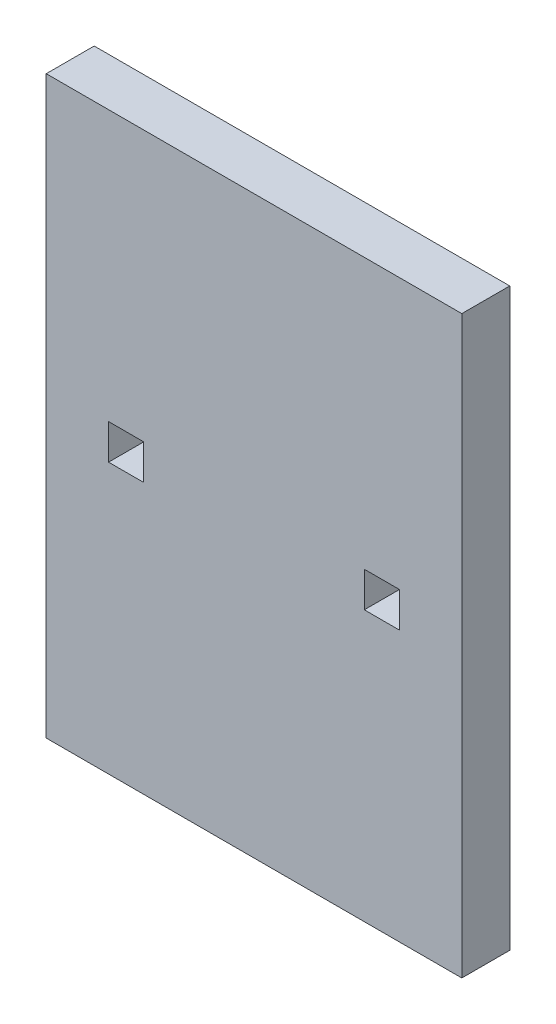
ISO-10303-21;
HEADER;
FILE_DESCRIPTION(('STEP AP214'),'2;1');
FILE_NAME('part.step','',(''),(''),'','','');
FILE_SCHEMA(('AUTOMOTIVE_DESIGN { 1 0 10303 214 1 1 1 1 }'));
ENDSEC;
DATA;
#1=APPLICATION_CONTEXT('core data for automotive mechanical design processes');
#2=APPLICATION_PROTOCOL_DEFINITION('international standard','automotive_design',2000,#1);
#3=PRODUCT_CONTEXT('',#1,'mechanical');
#4=PRODUCT('Part','Part','',(#3));
#5=PRODUCT_RELATED_PRODUCT_CATEGORY('part','',(#4));
#6=PRODUCT_DEFINITION_FORMATION('','',#4);
#7=PRODUCT_DEFINITION_CONTEXT('part definition',#1,'design');
#8=PRODUCT_DEFINITION('design','',#6,#7);
#9=PRODUCT_DEFINITION_SHAPE('','',#8);
#10=(LENGTH_UNIT() NAMED_UNIT(*) SI_UNIT(.MILLI.,.METRE.));
#11=(NAMED_UNIT(*) PLANE_ANGLE_UNIT() SI_UNIT($,.RADIAN.));
#12=(NAMED_UNIT(*) SI_UNIT($,.STERADIAN.) SOLID_ANGLE_UNIT());
#13=UNCERTAINTY_MEASURE_WITH_UNIT(LENGTH_MEASURE(1.E-05),#10,'distance_accuracy_value','');
#14=(GEOMETRIC_REPRESENTATION_CONTEXT(3) GLOBAL_UNCERTAINTY_ASSIGNED_CONTEXT((#13)) GLOBAL_UNIT_ASSIGNED_CONTEXT((#10,
#11,#12)) REPRESENTATION_CONTEXT('',''));
#15=CARTESIAN_POINT('',(0.,0.,0.));
#16=DIRECTION('',(0.,0.,1.));
#17=DIRECTION('',(1.,0.,0.));
#18=AXIS2_PLACEMENT_3D('',#15,#16,#17);
#19=CARTESIAN_POINT('',(0.,0.,30.));
#20=DIRECTION('',(0.,0.,1.));
#21=DIRECTION('',(1.,0.,0.));
#22=AXIS2_PLACEMENT_3D('',#19,#20,#21);
#23=PLANE('',#22);
#24=DIRECTION('',(0.,-1.,0.));
#25=VECTOR('',#24,1.);
#26=CARTESIAN_POINT('',(0.,0.,30.));
#27=LINE('',#26,#25);
#28=CARTESIAN_POINT('',(0.,0.,30.));
#29=VERTEX_POINT('',#28);
#30=CARTESIAN_POINT('',(0.,-360.,30.));
#31=VERTEX_POINT('',#30);
#32=EDGE_CURVE('E188',#29,#31,#27,.T.);
#33=ORIENTED_EDGE('',*,*,#32,.T.);
#34=DIRECTION('',(1.,0.,0.));
#35=VECTOR('',#34,1.);
#36=CARTESIAN_POINT('',(0.,-360.,30.));
#37=LINE('',#36,#35);
#38=CARTESIAN_POINT('',(260.,-360.,30.));
#39=VERTEX_POINT('',#38);
#40=EDGE_CURVE('E191',#31,#39,#37,.T.);
#41=ORIENTED_EDGE('',*,*,#40,.T.);
#42=DIRECTION('',(0.,1.,0.));
#43=VECTOR('',#42,1.);
#44=CARTESIAN_POINT('',(260.,0.,30.));
#45=LINE('',#44,#43);
#46=CARTESIAN_POINT('',(260.,0.,30.));
#47=VERTEX_POINT('',#46);
#48=EDGE_CURVE('E194',#39,#47,#45,.T.);
#49=ORIENTED_EDGE('',*,*,#48,.T.);
#50=DIRECTION('',(-1.,0.,0.));
#51=VECTOR('',#50,1.);
#52=CARTESIAN_POINT('',(0.,0.,30.));
#53=LINE('',#52,#51);
#54=EDGE_CURVE('E196',#47,#29,#53,.T.);
#55=ORIENTED_EDGE('',*,*,#54,.T.);
#56=EDGE_LOOP('',(#33,#41,#49,#55));
#57=FACE_BOUND('',#56,.T.);
#58=DIRECTION('',(-1.,0.,0.));
#59=VECTOR('',#58,1.);
#60=CARTESIAN_POINT('',(39.0000000000001,-169.,30.));
#61=LINE('',#60,#59);
#62=CARTESIAN_POINT('',(61.0000000000001,-169.,30.));
#63=VERTEX_POINT('',#62);
#64=CARTESIAN_POINT('',(39.0000000000001,-169.,30.));
#65=VERTEX_POINT('',#64);
#66=EDGE_CURVE('E159',#63,#65,#61,.T.);
#67=ORIENTED_EDGE('',*,*,#66,.F.);
#68=DIRECTION('',(0.,1.,0.));
#69=VECTOR('',#68,1.);
#70=CARTESIAN_POINT('',(61.0000000000001,-169.,30.));
#71=LINE('',#70,#69);
#72=CARTESIAN_POINT('',(61.0000000000001,-191.,30.));
#73=VERTEX_POINT('',#72);
#74=EDGE_CURVE('E157',#73,#63,#71,.T.);
#75=ORIENTED_EDGE('',*,*,#74,.F.);
#76=DIRECTION('',(1.,0.,0.));
#77=VECTOR('',#76,1.);
#78=CARTESIAN_POINT('',(39.0000000000001,-191.,30.));
#79=LINE('',#78,#77);
#80=CARTESIAN_POINT('',(39.0000000000001,-191.,30.));
#81=VERTEX_POINT('',#80);
#82=EDGE_CURVE('E165',#81,#73,#79,.T.);
#83=ORIENTED_EDGE('',*,*,#82,.F.);
#84=DIRECTION('',(0.,-1.,0.));
#85=VECTOR('',#84,1.);
#86=CARTESIAN_POINT('',(39.0000000000001,-169.,30.));
#87=LINE('',#86,#85);
#88=EDGE_CURVE('E162',#65,#81,#87,.T.);
#89=ORIENTED_EDGE('',*,*,#88,.F.);
#90=EDGE_LOOP('',(#67,#75,#83,#89));
#91=FACE_BOUND('',#90,.T.);
#92=DIRECTION('',(-1.,0.,0.));
#93=VECTOR('',#92,1.);
#94=CARTESIAN_POINT('',(199.,-169.,30.));
#95=LINE('',#94,#93);
#96=CARTESIAN_POINT('',(221.,-169.,30.));
#97=VERTEX_POINT('',#96);
#98=CARTESIAN_POINT('',(199.,-169.,30.));
#99=VERTEX_POINT('',#98);
#100=EDGE_CURVE('E129',#97,#99,#95,.T.);
#101=ORIENTED_EDGE('',*,*,#100,.F.);
#102=DIRECTION('',(0.,1.,0.));
#103=VECTOR('',#102,1.);
#104=CARTESIAN_POINT('',(221.,-169.,30.));
#105=LINE('',#104,#103);
#106=CARTESIAN_POINT('',(221.,-191.,30.));
#107=VERTEX_POINT('',#106);
#108=EDGE_CURVE('E121',#107,#97,#105,.T.);
#109=ORIENTED_EDGE('',*,*,#108,.F.);
#110=DIRECTION('',(1.,0.,0.));
#111=VECTOR('',#110,1.);
#112=CARTESIAN_POINT('',(199.,-191.,30.));
#113=LINE('',#112,#111);
#114=CARTESIAN_POINT('',(199.,-191.,30.));
#115=VERTEX_POINT('',#114);
#116=EDGE_CURVE('E143',#115,#107,#113,.T.);
#117=ORIENTED_EDGE('',*,*,#116,.F.);
#118=DIRECTION('',(0.,-1.,0.));
#119=VECTOR('',#118,1.);
#120=CARTESIAN_POINT('',(199.,-169.,30.));
#121=LINE('',#120,#119);
#122=EDGE_CURVE('E141',#99,#115,#121,.T.);
#123=ORIENTED_EDGE('',*,*,#122,.F.);
#124=EDGE_LOOP('',(#101,#109,#117,#123));
#125=FACE_BOUND('',#124,.T.);
#126=ADVANCED_FACE('F32',(#57,#91,#125),#23,.T.);
#127=CARTESIAN_POINT('',(0.,0.,0.));
#128=DIRECTION('',(0.,0.,1.));
#129=DIRECTION('',(1.,0.,0.));
#130=AXIS2_PLACEMENT_3D('',#127,#128,#129);
#131=PLANE('',#130);
#132=DIRECTION('',(0.,1.,0.));
#133=VECTOR('',#132,1.);
#134=CARTESIAN_POINT('',(61.0000000000001,-169.,0.));
#135=LINE('',#134,#133);
#136=CARTESIAN_POINT('',(61.0000000000001,-191.,0.));
#137=VERTEX_POINT('',#136);
#138=CARTESIAN_POINT('',(61.0000000000001,-169.,0.));
#139=VERTEX_POINT('',#138);
#140=EDGE_CURVE('E137',#137,#139,#135,.T.);
#141=ORIENTED_EDGE('',*,*,#140,.T.);
#142=DIRECTION('',(-1.,0.,0.));
#143=VECTOR('',#142,1.);
#144=CARTESIAN_POINT('',(39.0000000000001,-169.,0.));
#145=LINE('',#144,#143);
#146=CARTESIAN_POINT('',(39.0000000000001,-169.,0.));
#147=VERTEX_POINT('',#146);
#148=EDGE_CURVE('E170',#139,#147,#145,.T.);
#149=ORIENTED_EDGE('',*,*,#148,.T.);
#150=DIRECTION('',(0.,-1.,0.));
#151=VECTOR('',#150,1.);
#152=CARTESIAN_POINT('',(39.0000000000001,-169.,0.));
#153=LINE('',#152,#151);
#154=CARTESIAN_POINT('',(39.0000000000001,-191.,0.));
#155=VERTEX_POINT('',#154);
#156=EDGE_CURVE('E173',#147,#155,#153,.T.);
#157=ORIENTED_EDGE('',*,*,#156,.T.);
#158=DIRECTION('',(1.,0.,0.));
#159=VECTOR('',#158,1.);
#160=CARTESIAN_POINT('',(39.0000000000001,-191.,0.));
#161=LINE('',#160,#159);
#162=EDGE_CURVE('E160',#155,#137,#161,.T.);
#163=ORIENTED_EDGE('',*,*,#162,.T.);
#164=EDGE_LOOP('',(#141,#149,#157,#163));
#165=FACE_BOUND('',#164,.T.);
#166=DIRECTION('',(0.,-1.,0.));
#167=VECTOR('',#166,1.);
#168=CARTESIAN_POINT('',(0.,0.,0.));
#169=LINE('',#168,#167);
#170=CARTESIAN_POINT('',(0.,0.,0.));
#171=VERTEX_POINT('',#170);
#172=CARTESIAN_POINT('',(0.,-360.,0.));
#173=VERTEX_POINT('',#172);
#174=EDGE_CURVE('E187',#171,#173,#169,.T.);
#175=ORIENTED_EDGE('',*,*,#174,.F.);
#176=DIRECTION('',(-1.,0.,0.));
#177=VECTOR('',#176,1.);
#178=CARTESIAN_POINT('',(0.,0.,0.));
#179=LINE('',#178,#177);
#180=CARTESIAN_POINT('',(260.,0.,0.));
#181=VERTEX_POINT('',#180);
#182=EDGE_CURVE('E192',#181,#171,#179,.T.);
#183=ORIENTED_EDGE('',*,*,#182,.F.);
#184=DIRECTION('',(0.,1.,0.));
#185=VECTOR('',#184,1.);
#186=CARTESIAN_POINT('',(260.,0.,0.));
#187=LINE('',#186,#185);
#188=CARTESIAN_POINT('',(260.,-360.,0.));
#189=VERTEX_POINT('',#188);
#190=EDGE_CURVE('E203',#189,#181,#187,.T.);
#191=ORIENTED_EDGE('',*,*,#190,.F.);
#192=DIRECTION('',(1.,0.,0.));
#193=VECTOR('',#192,1.);
#194=CARTESIAN_POINT('',(0.,-360.,0.));
#195=LINE('',#194,#193);
#196=EDGE_CURVE('E201',#173,#189,#195,.T.);
#197=ORIENTED_EDGE('',*,*,#196,.F.);
#198=EDGE_LOOP('',(#175,#183,#191,#197));
#199=FACE_BOUND('',#198,.T.);
#200=DIRECTION('',(0.,1.,0.));
#201=VECTOR('',#200,1.);
#202=CARTESIAN_POINT('',(221.,-169.,0.));
#203=LINE('',#202,#201);
#204=CARTESIAN_POINT('',(221.,-191.,0.));
#205=VERTEX_POINT('',#204);
#206=CARTESIAN_POINT('',(221.,-169.,0.));
#207=VERTEX_POINT('',#206);
#208=EDGE_CURVE('E55',#205,#207,#203,.T.);
#209=ORIENTED_EDGE('',*,*,#208,.T.);
#210=DIRECTION('',(-1.,0.,0.));
#211=VECTOR('',#210,1.);
#212=CARTESIAN_POINT('',(199.,-169.,0.));
#213=LINE('',#212,#211);
#214=CARTESIAN_POINT('',(199.,-169.,0.));
#215=VERTEX_POINT('',#214);
#216=EDGE_CURVE('E136',#207,#215,#213,.T.);
#217=ORIENTED_EDGE('',*,*,#216,.T.);
#218=DIRECTION('',(0.,-1.,0.));
#219=VECTOR('',#218,1.);
#220=CARTESIAN_POINT('',(199.,-169.,0.));
#221=LINE('',#220,#219);
#222=CARTESIAN_POINT('',(199.,-191.,0.));
#223=VERTEX_POINT('',#222);
#224=EDGE_CURVE('E149',#215,#223,#221,.T.);
#225=ORIENTED_EDGE('',*,*,#224,.T.);
#226=DIRECTION('',(1.,0.,0.));
#227=VECTOR('',#226,1.);
#228=CARTESIAN_POINT('',(199.,-191.,0.));
#229=LINE('',#228,#227);
#230=EDGE_CURVE('E130',#223,#205,#229,.T.);
#231=ORIENTED_EDGE('',*,*,#230,.T.);
#232=EDGE_LOOP('',(#209,#217,#225,#231));
#233=FACE_BOUND('',#232,.T.);
#234=ADVANCED_FACE('F221',(#165,#199,#233),#131,.F.);
#235=CARTESIAN_POINT('',(0.,0.,30.));
#236=DIRECTION('',(1.,0.,0.));
#237=DIRECTION('',(0.,1.,0.));
#238=AXIS2_PLACEMENT_3D('',#235,#236,#237);
#239=PLANE('',#238);
#240=ORIENTED_EDGE('',*,*,#174,.T.);
#241=DIRECTION('',(0.,0.,-1.));
#242=VECTOR('',#241,1.);
#243=CARTESIAN_POINT('',(0.,-360.,30.));
#244=LINE('',#243,#242);
#245=EDGE_CURVE('E11',#31,#173,#244,.T.);
#246=ORIENTED_EDGE('',*,*,#245,.F.);
#247=ORIENTED_EDGE('',*,*,#32,.F.);
#248=DIRECTION('',(0.,0.,-1.));
#249=VECTOR('',#248,1.);
#250=CARTESIAN_POINT('',(0.,0.,30.));
#251=LINE('',#250,#249);
#252=EDGE_CURVE('E198',#29,#171,#251,.T.);
#253=ORIENTED_EDGE('',*,*,#252,.T.);
#254=EDGE_LOOP('',(#240,#246,#247,#253));
#255=FACE_BOUND('',#254,.T.);
#256=ADVANCED_FACE('F34',(#255),#239,.F.);
#257=CARTESIAN_POINT('',(0.,-360.,30.));
#258=DIRECTION('',(0.,1.,0.));
#259=DIRECTION('',(0.,0.,1.));
#260=AXIS2_PLACEMENT_3D('',#257,#258,#259);
#261=PLANE('',#260);
#262=ORIENTED_EDGE('',*,*,#196,.T.);
#263=DIRECTION('',(0.,0.,-1.));
#264=VECTOR('',#263,1.);
#265=CARTESIAN_POINT('',(260.,-360.,30.));
#266=LINE('',#265,#264);
#267=EDGE_CURVE('E40',#39,#189,#266,.T.);
#268=ORIENTED_EDGE('',*,*,#267,.F.);
#269=ORIENTED_EDGE('',*,*,#40,.F.);
#270=ORIENTED_EDGE('',*,*,#245,.T.);
#271=EDGE_LOOP('',(#262,#268,#269,#270));
#272=FACE_BOUND('',#271,.T.);
#273=ADVANCED_FACE('F232',(#272),#261,.F.);
#274=CARTESIAN_POINT('',(260.,0.,30.));
#275=DIRECTION('',(-1.,0.,0.));
#276=DIRECTION('',(0.,-1.,0.));
#277=AXIS2_PLACEMENT_3D('',#274,#275,#276);
#278=PLANE('',#277);
#279=ORIENTED_EDGE('',*,*,#190,.T.);
#280=DIRECTION('',(0.,0.,-1.));
#281=VECTOR('',#280,1.);
#282=CARTESIAN_POINT('',(260.,0.,30.));
#283=LINE('',#282,#281);
#284=EDGE_CURVE('E208',#47,#181,#283,.T.);
#285=ORIENTED_EDGE('',*,*,#284,.F.);
#286=ORIENTED_EDGE('',*,*,#48,.F.);
#287=ORIENTED_EDGE('',*,*,#267,.T.);
#288=EDGE_LOOP('',(#279,#285,#286,#287));
#289=FACE_BOUND('',#288,.T.);
#290=ADVANCED_FACE('F215',(#289),#278,.F.);
#291=CARTESIAN_POINT('',(0.,0.,30.));
#292=DIRECTION('',(0.,-1.,0.));
#293=DIRECTION('',(0.,0.,-1.));
#294=AXIS2_PLACEMENT_3D('',#291,#292,#293);
#295=PLANE('',#294);
#296=ORIENTED_EDGE('',*,*,#182,.T.);
#297=ORIENTED_EDGE('',*,*,#252,.F.);
#298=ORIENTED_EDGE('',*,*,#54,.F.);
#299=ORIENTED_EDGE('',*,*,#284,.T.);
#300=EDGE_LOOP('',(#296,#297,#298,#299));
#301=FACE_BOUND('',#300,.T.);
#302=ADVANCED_FACE('F225',(#301),#295,.F.);
#303=CARTESIAN_POINT('',(61.0000000000001,-169.,30.));
#304=DIRECTION('',(-1.,0.,0.));
#305=DIRECTION('',(0.,0.,1.));
#306=AXIS2_PLACEMENT_3D('',#303,#304,#305);
#307=PLANE('',#306);
#308=ORIENTED_EDGE('',*,*,#140,.F.);
#309=DIRECTION('',(0.,0.,-1.));
#310=VECTOR('',#309,1.);
#311=CARTESIAN_POINT('',(61.0000000000001,-191.,30.));
#312=LINE('',#311,#310);
#313=EDGE_CURVE('E167',#73,#137,#312,.T.);
#314=ORIENTED_EDGE('',*,*,#313,.F.);
#315=ORIENTED_EDGE('',*,*,#74,.T.);
#316=DIRECTION('',(0.,0.,-1.));
#317=VECTOR('',#316,1.);
#318=CARTESIAN_POINT('',(61.0000000000001,-169.,30.));
#319=LINE('',#318,#317);
#320=EDGE_CURVE('E184',#63,#139,#319,.T.);
#321=ORIENTED_EDGE('',*,*,#320,.T.);
#322=EDGE_LOOP('',(#308,#314,#315,#321));
#323=FACE_BOUND('',#322,.T.);
#324=ADVANCED_FACE('F247',(#323),#307,.T.);
#325=CARTESIAN_POINT('',(39.0000000000001,-169.,30.));
#326=DIRECTION('',(0.,-1.,0.));
#327=DIRECTION('',(0.,0.,-1.));
#328=AXIS2_PLACEMENT_3D('',#325,#326,#327);
#329=PLANE('',#328);
#330=ORIENTED_EDGE('',*,*,#148,.F.);
#331=ORIENTED_EDGE('',*,*,#320,.F.);
#332=ORIENTED_EDGE('',*,*,#66,.T.);
#333=DIRECTION('',(0.,0.,-1.));
#334=VECTOR('',#333,1.);
#335=CARTESIAN_POINT('',(39.0000000000001,-169.,30.));
#336=LINE('',#335,#334);
#337=EDGE_CURVE('E182',#65,#147,#336,.T.);
#338=ORIENTED_EDGE('',*,*,#337,.T.);
#339=EDGE_LOOP('',(#330,#331,#332,#338));
#340=FACE_BOUND('',#339,.T.);
#341=ADVANCED_FACE('F254',(#340),#329,.T.);
#342=CARTESIAN_POINT('',(39.0000000000001,-169.,30.));
#343=DIRECTION('',(1.,0.,0.));
#344=DIRECTION('',(0.,1.,0.));
#345=AXIS2_PLACEMENT_3D('',#342,#343,#344);
#346=PLANE('',#345);
#347=ORIENTED_EDGE('',*,*,#156,.F.);
#348=ORIENTED_EDGE('',*,*,#337,.F.);
#349=ORIENTED_EDGE('',*,*,#88,.T.);
#350=DIRECTION('',(0.,0.,-1.));
#351=VECTOR('',#350,1.);
#352=CARTESIAN_POINT('',(39.0000000000001,-191.,30.));
#353=LINE('',#352,#351);
#354=EDGE_CURVE('E180',#81,#155,#353,.T.);
#355=ORIENTED_EDGE('',*,*,#354,.T.);
#356=EDGE_LOOP('',(#347,#348,#349,#355));
#357=FACE_BOUND('',#356,.T.);
#358=ADVANCED_FACE('F259',(#357),#346,.T.);
#359=CARTESIAN_POINT('',(39.0000000000001,-191.,30.));
#360=DIRECTION('',(0.,1.,0.));
#361=DIRECTION('',(0.,0.,1.));
#362=AXIS2_PLACEMENT_3D('',#359,#360,#361);
#363=PLANE('',#362);
#364=ORIENTED_EDGE('',*,*,#162,.F.);
#365=ORIENTED_EDGE('',*,*,#354,.F.);
#366=ORIENTED_EDGE('',*,*,#82,.T.);
#367=ORIENTED_EDGE('',*,*,#313,.T.);
#368=EDGE_LOOP('',(#364,#365,#366,#367));
#369=FACE_BOUND('',#368,.T.);
#370=ADVANCED_FACE('F266',(#369),#363,.T.);
#371=CARTESIAN_POINT('',(221.,-169.,30.));
#372=DIRECTION('',(-1.,0.,0.));
#373=DIRECTION('',(0.,0.,1.));
#374=AXIS2_PLACEMENT_3D('',#371,#372,#373);
#375=PLANE('',#374);
#376=ORIENTED_EDGE('',*,*,#208,.F.);
#377=DIRECTION('',(0.,0.,-1.));
#378=VECTOR('',#377,1.);
#379=CARTESIAN_POINT('',(221.,-191.,30.));
#380=LINE('',#379,#378);
#381=EDGE_CURVE('E125',#107,#205,#380,.T.);
#382=ORIENTED_EDGE('',*,*,#381,.F.);
#383=ORIENTED_EDGE('',*,*,#108,.T.);
#384=DIRECTION('',(0.,0.,-1.));
#385=VECTOR('',#384,1.);
#386=CARTESIAN_POINT('',(221.,-169.,30.));
#387=LINE('',#386,#385);
#388=EDGE_CURVE('E124',#97,#207,#387,.T.);
#389=ORIENTED_EDGE('',*,*,#388,.T.);
#390=EDGE_LOOP('',(#376,#382,#383,#389));
#391=FACE_BOUND('',#390,.T.);
#392=ADVANCED_FACE('F123',(#391),#375,.T.);
#393=CARTESIAN_POINT('',(199.,-169.,30.));
#394=DIRECTION('',(0.,-1.,0.));
#395=DIRECTION('',(0.,0.,-1.));
#396=AXIS2_PLACEMENT_3D('',#393,#394,#395);
#397=PLANE('',#396);
#398=ORIENTED_EDGE('',*,*,#216,.F.);
#399=ORIENTED_EDGE('',*,*,#388,.F.);
#400=ORIENTED_EDGE('',*,*,#100,.T.);
#401=DIRECTION('',(0.,0.,-1.));
#402=VECTOR('',#401,1.);
#403=CARTESIAN_POINT('',(199.,-169.,30.));
#404=LINE('',#403,#402);
#405=EDGE_CURVE('E138',#99,#215,#404,.T.);
#406=ORIENTED_EDGE('',*,*,#405,.T.);
#407=EDGE_LOOP('',(#398,#399,#400,#406));
#408=FACE_BOUND('',#407,.T.);
#409=ADVANCED_FACE('F133',(#408),#397,.T.);
#410=CARTESIAN_POINT('',(199.,-169.,30.));
#411=DIRECTION('',(1.,0.,0.));
#412=DIRECTION('',(0.,0.,-1.));
#413=AXIS2_PLACEMENT_3D('',#410,#411,#412);
#414=PLANE('',#413);
#415=ORIENTED_EDGE('',*,*,#224,.F.);
#416=ORIENTED_EDGE('',*,*,#405,.F.);
#417=ORIENTED_EDGE('',*,*,#122,.T.);
#418=DIRECTION('',(0.,0.,-1.));
#419=VECTOR('',#418,1.);
#420=CARTESIAN_POINT('',(199.,-191.,30.));
#421=LINE('',#420,#419);
#422=EDGE_CURVE('E47',#115,#223,#421,.T.);
#423=ORIENTED_EDGE('',*,*,#422,.T.);
#424=EDGE_LOOP('',(#415,#416,#417,#423));
#425=FACE_BOUND('',#424,.T.);
#426=ADVANCED_FACE('F284',(#425),#414,.T.);
#427=CARTESIAN_POINT('',(199.,-191.,30.));
#428=DIRECTION('',(0.,1.,0.));
#429=DIRECTION('',(0.,0.,1.));
#430=AXIS2_PLACEMENT_3D('',#427,#428,#429);
#431=PLANE('',#430);
#432=ORIENTED_EDGE('',*,*,#230,.F.);
#433=ORIENTED_EDGE('',*,*,#422,.F.);
#434=ORIENTED_EDGE('',*,*,#116,.T.);
#435=ORIENTED_EDGE('',*,*,#381,.T.);
#436=EDGE_LOOP('',(#432,#433,#434,#435));
#437=FACE_BOUND('',#436,.T.);
#438=ADVANCED_FACE('F287',(#437),#431,.T.);
#439=CLOSED_SHELL('',(#126,#234,#256,#273,#290,#302,#324,#341,#358,#370,#392,#409,#426,#438));
#440=MANIFOLD_SOLID_BREP('B2',#439);
#441=ADVANCED_BREP_SHAPE_REPRESENTATION('',(#18,#440),#14);
#442=SHAPE_DEFINITION_REPRESENTATION(#9,#441);
ENDSEC;
END-ISO-10303-21;
